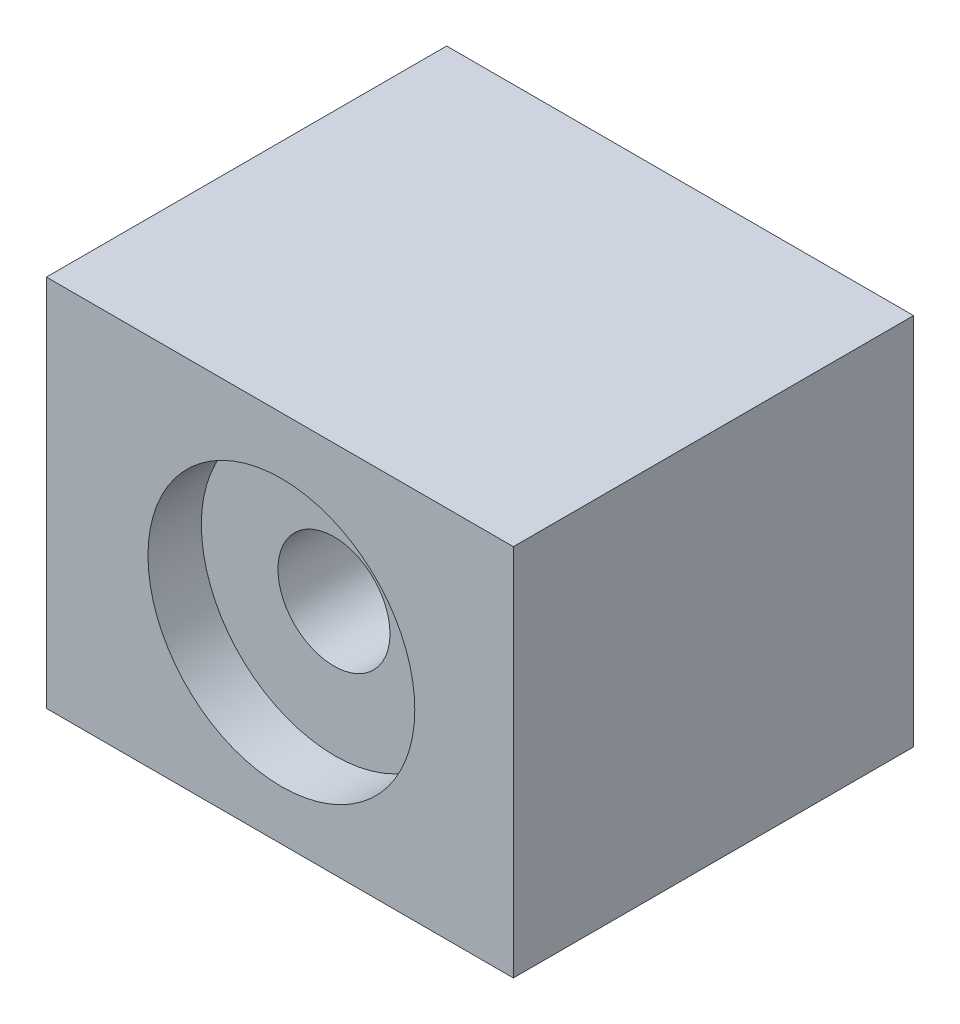
ISO-10303-21;
HEADER;
FILE_DESCRIPTION(('STEP AP214'),'2;1');
FILE_NAME('part.step','',(''),(''),'','','');
FILE_SCHEMA(('AUTOMOTIVE_DESIGN { 1 0 10303 214 1 1 1 1 }'));
ENDSEC;
DATA;
#1=APPLICATION_CONTEXT('core data for automotive mechanical design processes');
#2=APPLICATION_PROTOCOL_DEFINITION('international standard','automotive_design',2000,#1);
#3=PRODUCT_CONTEXT('',#1,'mechanical');
#4=PRODUCT('Part','Part','',(#3));
#5=PRODUCT_RELATED_PRODUCT_CATEGORY('part','',(#4));
#6=PRODUCT_DEFINITION_FORMATION('','',#4);
#7=PRODUCT_DEFINITION_CONTEXT('part definition',#1,'design');
#8=PRODUCT_DEFINITION('design','',#6,#7);
#9=PRODUCT_DEFINITION_SHAPE('','',#8);
#10=(LENGTH_UNIT() NAMED_UNIT(*) SI_UNIT(.MILLI.,.METRE.));
#11=(NAMED_UNIT(*) PLANE_ANGLE_UNIT() SI_UNIT($,.RADIAN.));
#12=(NAMED_UNIT(*) SI_UNIT($,.STERADIAN.) SOLID_ANGLE_UNIT());
#13=UNCERTAINTY_MEASURE_WITH_UNIT(LENGTH_MEASURE(1.E-05),#10,'distance_accuracy_value','');
#14=(GEOMETRIC_REPRESENTATION_CONTEXT(3) GLOBAL_UNCERTAINTY_ASSIGNED_CONTEXT((#13)) GLOBAL_UNIT_ASSIGNED_CONTEXT((#10,
#11,#12)) REPRESENTATION_CONTEXT('',''));
#15=CARTESIAN_POINT('',(0.,0.,0.));
#16=DIRECTION('',(0.,0.,1.));
#17=DIRECTION('',(1.,0.,0.));
#18=AXIS2_PLACEMENT_3D('',#15,#16,#17);
#19=CARTESIAN_POINT('',(-20.1515151515152,28.,-10.7828282828283));
#20=DIRECTION('',(1.,0.,0.));
#21=DIRECTION('',(0.,0.,-1.));
#22=AXIS2_PLACEMENT_3D('',#19,#20,#21);
#23=PLANE('',#22);
#24=DIRECTION('',(0.,0.,1.));
#25=VECTOR('',#24,1.);
#26=CARTESIAN_POINT('',(-20.1515151515152,0.,-10.7828282828283));
#27=LINE('',#26,#25);
#28=CARTESIAN_POINT('',(-20.1515151515152,0.,-10.7828282828283));
#29=VERTEX_POINT('',#28);
#30=CARTESIAN_POINT('',(-20.1515151515151,0.,19.2171717171717));
#31=VERTEX_POINT('',#30);
#32=EDGE_CURVE('E109',#29,#31,#27,.T.);
#33=ORIENTED_EDGE('',*,*,#32,.T.);
#34=DIRECTION('',(0.,-1.,0.));
#35=VECTOR('',#34,1.);
#36=CARTESIAN_POINT('',(-20.1515151515151,28.,19.2171717171717));
#37=LINE('',#36,#35);
#38=CARTESIAN_POINT('',(-20.1515151515151,28.,19.2171717171717));
#39=VERTEX_POINT('',#38);
#40=EDGE_CURVE('E13',#39,#31,#37,.T.);
#41=ORIENTED_EDGE('',*,*,#40,.F.);
#42=DIRECTION('',(0.,0.,1.));
#43=VECTOR('',#42,1.);
#44=CARTESIAN_POINT('',(-20.1515151515152,28.,-10.7828282828283));
#45=LINE('',#44,#43);
#46=CARTESIAN_POINT('',(-20.1515151515152,28.,-10.7828282828283));
#47=VERTEX_POINT('',#46);
#48=EDGE_CURVE('E96',#47,#39,#45,.T.);
#49=ORIENTED_EDGE('',*,*,#48,.F.);
#50=DIRECTION('',(0.,-1.,0.));
#51=VECTOR('',#50,1.);
#52=CARTESIAN_POINT('',(-20.1515151515152,28.,-10.7828282828283));
#53=LINE('',#52,#51);
#54=EDGE_CURVE('E105',#47,#29,#53,.T.);
#55=ORIENTED_EDGE('',*,*,#54,.T.);
#56=EDGE_LOOP('',(#33,#41,#49,#55));
#57=FACE_BOUND('',#56,.T.);
#58=ADVANCED_FACE('F44',(#57),#23,.F.);
#59=CARTESIAN_POINT('',(-20.1515151515151,28.,19.2171717171717));
#60=DIRECTION('',(0.,0.,-1.));
#61=DIRECTION('',(-1.,0.,0.));
#62=AXIS2_PLACEMENT_3D('',#59,#60,#61);
#63=PLANE('',#62);
#64=CARTESIAN_POINT('',(-2.53880738620715,13.7333721009352,19.2171717171717));
#65=DIRECTION('',(0.,0.,1.));
#66=DIRECTION('',(1.,0.,0.));
#67=AXIS2_PLACEMENT_3D('',#64,#65,#66);
#68=CIRCLE('',#67,10.);
#69=CARTESIAN_POINT('',(7.46119261379285,13.7333721009352,19.2171717171717));
#70=VERTEX_POINT('',#69);
#71=EDGE_CURVE('E123',#70,#70,#68,.T.);
#72=ORIENTED_EDGE('',*,*,#71,.F.);
#73=EDGE_LOOP('',(#72));
#74=FACE_BOUND('',#73,.T.);
#75=DIRECTION('',(1.,0.,0.));
#76=VECTOR('',#75,1.);
#77=CARTESIAN_POINT('',(-20.1515151515151,0.,19.2171717171717));
#78=LINE('',#77,#76);
#79=CARTESIAN_POINT('',(14.8484848484849,0.,19.2171717171717));
#80=VERTEX_POINT('',#79);
#81=EDGE_CURVE('E100',#31,#80,#78,.T.);
#82=ORIENTED_EDGE('',*,*,#81,.T.);
#83=DIRECTION('',(0.,-1.,0.));
#84=VECTOR('',#83,1.);
#85=CARTESIAN_POINT('',(14.8484848484849,28.,19.2171717171717));
#86=LINE('',#85,#84);
#87=CARTESIAN_POINT('',(14.8484848484849,28.,19.2171717171717));
#88=VERTEX_POINT('',#87);
#89=EDGE_CURVE('E53',#88,#80,#86,.T.);
#90=ORIENTED_EDGE('',*,*,#89,.F.);
#91=DIRECTION('',(1.,0.,0.));
#92=VECTOR('',#91,1.);
#93=CARTESIAN_POINT('',(-20.1515151515151,28.,19.2171717171717));
#94=LINE('',#93,#92);
#95=EDGE_CURVE('E91',#39,#88,#94,.T.);
#96=ORIENTED_EDGE('',*,*,#95,.F.);
#97=ORIENTED_EDGE('',*,*,#40,.T.);
#98=EDGE_LOOP('',(#82,#90,#96,#97));
#99=FACE_BOUND('',#98,.T.);
#100=ADVANCED_FACE('F99',(#74,#99),#63,.F.);
#101=CARTESIAN_POINT('',(14.8484848484849,28.,-10.7828282828283));
#102=DIRECTION('',(-1.,0.,0.));
#103=DIRECTION('',(0.,0.,1.));
#104=AXIS2_PLACEMENT_3D('',#101,#102,#103);
#105=PLANE('',#104);
#106=DIRECTION('',(0.,0.,-1.));
#107=VECTOR('',#106,1.);
#108=CARTESIAN_POINT('',(14.8484848484849,0.,-10.7828282828283));
#109=LINE('',#108,#107);
#110=CARTESIAN_POINT('',(14.8484848484849,0.,-10.7828282828283));
#111=VERTEX_POINT('',#110);
#112=EDGE_CURVE('E78',#80,#111,#109,.T.);
#113=ORIENTED_EDGE('',*,*,#112,.T.);
#114=DIRECTION('',(0.,-1.,0.));
#115=VECTOR('',#114,1.);
#116=CARTESIAN_POINT('',(14.8484848484849,28.,-10.7828282828283));
#117=LINE('',#116,#115);
#118=CARTESIAN_POINT('',(14.8484848484849,28.,-10.7828282828283));
#119=VERTEX_POINT('',#118);
#120=EDGE_CURVE('E101',#119,#111,#117,.T.);
#121=ORIENTED_EDGE('',*,*,#120,.F.);
#122=DIRECTION('',(0.,0.,-1.));
#123=VECTOR('',#122,1.);
#124=CARTESIAN_POINT('',(14.8484848484849,28.,-10.7828282828283));
#125=LINE('',#124,#123);
#126=EDGE_CURVE('E94',#88,#119,#125,.T.);
#127=ORIENTED_EDGE('',*,*,#126,.F.);
#128=ORIENTED_EDGE('',*,*,#89,.T.);
#129=EDGE_LOOP('',(#113,#121,#127,#128));
#130=FACE_BOUND('',#129,.T.);
#131=ADVANCED_FACE('F103',(#130),#105,.F.);
#132=CARTESIAN_POINT('',(-20.1515151515152,28.,-10.7828282828283));
#133=DIRECTION('',(0.,0.,1.));
#134=DIRECTION('',(1.,0.,0.));
#135=AXIS2_PLACEMENT_3D('',#132,#133,#134);
#136=PLANE('',#135);
#137=CARTESIAN_POINT('',(-2.59760269588583,13.7230846531367,-10.7828282828283));
#138=DIRECTION('',(0.,0.,1.));
#139=DIRECTION('',(1.,0.,0.));
#140=AXIS2_PLACEMENT_3D('',#137,#138,#139);
#141=CIRCLE('',#140,4.2);
#142=CARTESIAN_POINT('',(1.60239730411418,13.7230846531367,-10.7828282828283));
#143=VERTEX_POINT('',#142);
#144=EDGE_CURVE('E126',#143,#143,#141,.T.);
#145=ORIENTED_EDGE('',*,*,#144,.T.);
#146=EDGE_LOOP('',(#145));
#147=FACE_BOUND('',#146,.T.);
#148=DIRECTION('',(-1.,0.,0.));
#149=VECTOR('',#148,1.);
#150=CARTESIAN_POINT('',(-20.1515151515152,0.,-10.7828282828283));
#151=LINE('',#150,#149);
#152=EDGE_CURVE('E84',#111,#29,#151,.T.);
#153=ORIENTED_EDGE('',*,*,#152,.T.);
#154=ORIENTED_EDGE('',*,*,#54,.F.);
#155=DIRECTION('',(-1.,0.,0.));
#156=VECTOR('',#155,1.);
#157=CARTESIAN_POINT('',(-20.1515151515152,28.,-10.7828282828283));
#158=LINE('',#157,#156);
#159=EDGE_CURVE('E61',#119,#47,#158,.T.);
#160=ORIENTED_EDGE('',*,*,#159,.F.);
#161=ORIENTED_EDGE('',*,*,#120,.T.);
#162=EDGE_LOOP('',(#153,#154,#160,#161));
#163=FACE_BOUND('',#162,.T.);
#164=ADVANCED_FACE('F117',(#147,#163),#136,.F.);
#165=CARTESIAN_POINT('',(0.,28.,0.));
#166=DIRECTION('',(0.,1.,0.));
#167=DIRECTION('',(0.,0.,1.));
#168=AXIS2_PLACEMENT_3D('',#165,#166,#167);
#169=PLANE('',#168);
#170=ORIENTED_EDGE('',*,*,#48,.T.);
#171=ORIENTED_EDGE('',*,*,#95,.T.);
#172=ORIENTED_EDGE('',*,*,#126,.T.);
#173=ORIENTED_EDGE('',*,*,#159,.T.);
#174=EDGE_LOOP('',(#170,#171,#172,#173));
#175=FACE_BOUND('',#174,.T.);
#176=ADVANCED_FACE('F92',(#175),#169,.T.);
#177=CARTESIAN_POINT('',(0.,0.,0.));
#178=DIRECTION('',(0.,1.,0.));
#179=DIRECTION('',(0.,0.,1.));
#180=AXIS2_PLACEMENT_3D('',#177,#178,#179);
#181=PLANE('',#180);
#182=ORIENTED_EDGE('',*,*,#32,.F.);
#183=ORIENTED_EDGE('',*,*,#152,.F.);
#184=ORIENTED_EDGE('',*,*,#112,.F.);
#185=ORIENTED_EDGE('',*,*,#81,.F.);
#186=EDGE_LOOP('',(#182,#183,#184,#185));
#187=FACE_BOUND('',#186,.T.);
#188=ADVANCED_FACE('F120',(#187),#181,.F.);
#189=CARTESIAN_POINT('',(-2.53880738620715,13.7333721009352,15.2171717171717));
#190=DIRECTION('',(0.,0.,1.));
#191=DIRECTION('',(1.,0.,0.));
#192=AXIS2_PLACEMENT_3D('',#189,#190,#191);
#193=CYLINDRICAL_SURFACE('',#192,10.);
#194=CARTESIAN_POINT('',(-2.53880738620715,13.7333721009352,15.2171717171717));
#195=DIRECTION('',(0.,0.,1.));
#196=DIRECTION('',(1.,0.,0.));
#197=AXIS2_PLACEMENT_3D('',#194,#195,#196);
#198=CIRCLE('',#197,10.);
#199=CARTESIAN_POINT('',(7.46119261379285,13.7333721009352,15.2171717171717));
#200=VERTEX_POINT('',#199);
#201=EDGE_CURVE('E112',#200,#200,#198,.T.);
#202=ORIENTED_EDGE('',*,*,#201,.F.);
#203=EDGE_LOOP('',(#202));
#204=FACE_BOUND('',#203,.T.);
#205=ORIENTED_EDGE('',*,*,#71,.T.);
#206=EDGE_LOOP('',(#205));
#207=FACE_BOUND('',#206,.T.);
#208=ADVANCED_FACE('F141',(#204,#207),#193,.F.);
#209=CARTESIAN_POINT('',(-2.53880738620715,13.7333721009352,15.2171717171717));
#210=DIRECTION('',(0.,0.,1.));
#211=DIRECTION('',(1.,0.,0.));
#212=AXIS2_PLACEMENT_3D('',#209,#210,#211);
#213=PLANE('',#212);
#214=CARTESIAN_POINT('',(-2.59760269588583,13.7230846531367,15.2171717171717));
#215=DIRECTION('',(0.,0.,1.));
#216=DIRECTION('',(1.,0.,0.));
#217=AXIS2_PLACEMENT_3D('',#214,#215,#216);
#218=CIRCLE('',#217,4.2);
#219=CARTESIAN_POINT('',(1.60239730411418,13.7230846531367,15.2171717171717));
#220=VERTEX_POINT('',#219);
#221=EDGE_CURVE('E47',#220,#220,#218,.T.);
#222=ORIENTED_EDGE('',*,*,#221,.F.);
#223=EDGE_LOOP('',(#222));
#224=FACE_BOUND('',#223,.T.);
#225=ORIENTED_EDGE('',*,*,#201,.T.);
#226=EDGE_LOOP('',(#225));
#227=FACE_BOUND('',#226,.T.);
#228=ADVANCED_FACE('F138',(#224,#227),#213,.T.);
#229=CARTESIAN_POINT('',(-2.59760269588583,13.7230846531367,-28.7828282828283));
#230=DIRECTION('',(0.,0.,1.));
#231=DIRECTION('',(1.,0.,0.));
#232=AXIS2_PLACEMENT_3D('',#229,#230,#231);
#233=CYLINDRICAL_SURFACE('',#232,4.2);
#234=ORIENTED_EDGE('',*,*,#221,.T.);
#235=EDGE_LOOP('',(#234));
#236=FACE_BOUND('',#235,.T.);
#237=ORIENTED_EDGE('',*,*,#144,.F.);
#238=EDGE_LOOP('',(#237));
#239=FACE_BOUND('',#238,.T.);
#240=ADVANCED_FACE('F135',(#236,#239),#233,.F.);
#241=CLOSED_SHELL('',(#58,#100,#131,#164,#176,#188,#208,#228,#240));
#242=MANIFOLD_SOLID_BREP('B2',#241);
#243=ADVANCED_BREP_SHAPE_REPRESENTATION('',(#18,#242),#14);
#244=SHAPE_DEFINITION_REPRESENTATION(#9,#243);
ENDSEC;
END-ISO-10303-21;
